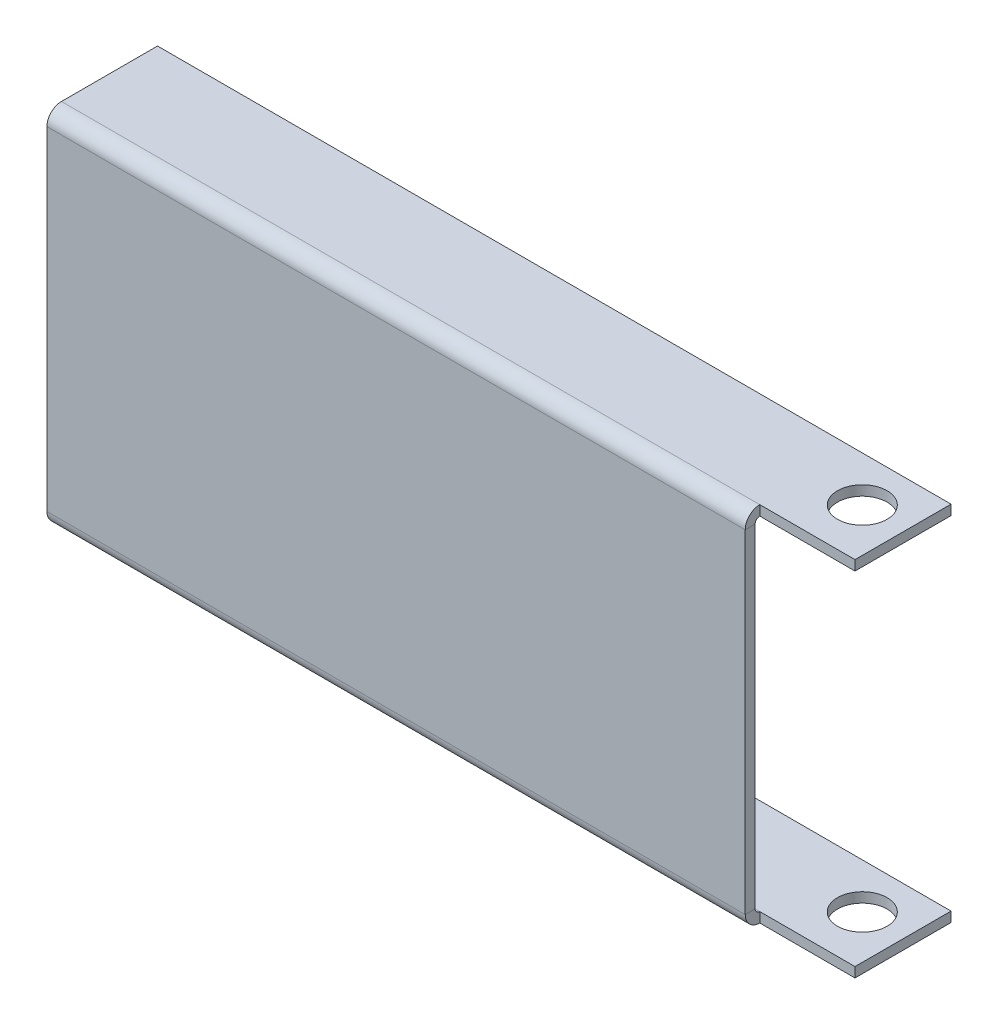
ISO-10303-21;
HEADER;
FILE_DESCRIPTION(('STEP AP214'),'2;1');
FILE_NAME('part.step','',(''),(''),'','','');
FILE_SCHEMA(('AUTOMOTIVE_DESIGN { 1 0 10303 214 1 1 1 1 }'));
ENDSEC;
DATA;
#1=APPLICATION_CONTEXT('core data for automotive mechanical design processes');
#2=APPLICATION_PROTOCOL_DEFINITION('international standard','automotive_design',2000,#1);
#3=PRODUCT_CONTEXT('',#1,'mechanical');
#4=PRODUCT('Part','Part','',(#3));
#5=PRODUCT_RELATED_PRODUCT_CATEGORY('part','',(#4));
#6=PRODUCT_DEFINITION_FORMATION('','',#4);
#7=PRODUCT_DEFINITION_CONTEXT('part definition',#1,'design');
#8=PRODUCT_DEFINITION('design','',#6,#7);
#9=PRODUCT_DEFINITION_SHAPE('','',#8);
#10=(LENGTH_UNIT() NAMED_UNIT(*) SI_UNIT(.MILLI.,.METRE.));
#11=(NAMED_UNIT(*) PLANE_ANGLE_UNIT() SI_UNIT($,.RADIAN.));
#12=(NAMED_UNIT(*) SI_UNIT($,.STERADIAN.) SOLID_ANGLE_UNIT());
#13=UNCERTAINTY_MEASURE_WITH_UNIT(LENGTH_MEASURE(1.E-05),#10,'distance_accuracy_value','');
#14=(GEOMETRIC_REPRESENTATION_CONTEXT(3) GLOBAL_UNCERTAINTY_ASSIGNED_CONTEXT((#13)) GLOBAL_UNIT_ASSIGNED_CONTEXT((#10,
#11,#12)) REPRESENTATION_CONTEXT('',''));
#15=CARTESIAN_POINT('',(0.,0.,0.));
#16=DIRECTION('',(0.,0.,1.));
#17=DIRECTION('',(1.,0.,0.));
#18=AXIS2_PLACEMENT_3D('',#15,#16,#17);
#19=CARTESIAN_POINT('',(0.,0.,-1.5875));
#20=DIRECTION('',(0.,0.,-1.));
#21=DIRECTION('',(-1.,0.,0.));
#22=AXIS2_PLACEMENT_3D('',#19,#20,#21);
#23=PLANE('',#22);
#24=DIRECTION('',(-1.,0.,0.));
#25=VECTOR('',#24,1.);
#26=CARTESIAN_POINT('',(0.,26.67,-1.5875));
#27=LINE('',#26,#25);
#28=CARTESIAN_POINT('',(48.26,26.67,-1.5875));
#29=VERTEX_POINT('',#28);
#30=CARTESIAN_POINT('',(-63.5,26.67,-1.5875));
#31=VERTEX_POINT('',#30);
#32=EDGE_CURVE('E229',#29,#31,#27,.T.);
#33=ORIENTED_EDGE('',*,*,#32,.F.);
#34=DIRECTION('',(0.,1.,0.));
#35=VECTOR('',#34,1.);
#36=CARTESIAN_POINT('',(48.26,0.,-1.5874999999999));
#37=LINE('',#36,#35);
#38=CARTESIAN_POINT('',(48.26,-26.67,-1.5875));
#39=VERTEX_POINT('',#38);
#40=EDGE_CURVE('E281',#29,#39,#37,.F.);
#41=ORIENTED_EDGE('',*,*,#40,.T.);
#42=DIRECTION('',(-1.,0.,0.));
#43=VECTOR('',#42,1.);
#44=CARTESIAN_POINT('',(0.,-26.67,-1.5875));
#45=LINE('',#44,#43);
#46=CARTESIAN_POINT('',(-63.5,-26.67,-1.5875));
#47=VERTEX_POINT('',#46);
#48=EDGE_CURVE('E237',#39,#47,#45,.T.);
#49=ORIENTED_EDGE('',*,*,#48,.T.);
#50=DIRECTION('',(0.,-1.,0.));
#51=VECTOR('',#50,1.);
#52=CARTESIAN_POINT('',(-63.5,44.4500000000001,-1.5875));
#53=LINE('',#52,#51);
#54=EDGE_CURVE('E232',#31,#47,#53,.T.);
#55=ORIENTED_EDGE('',*,*,#54,.F.);
#56=EDGE_LOOP('',(#33,#41,#49,#55));
#57=FACE_BOUND('',#56,.T.);
#58=ADVANCED_FACE('F46',(#57),#23,.T.);
#59=CARTESIAN_POINT('',(0.,0.,0.));
#60=DIRECTION('',(0.,0.,-1.));
#61=DIRECTION('',(-1.,0.,0.));
#62=AXIS2_PLACEMENT_3D('',#59,#60,#61);
#63=PLANE('',#62);
#64=DIRECTION('',(0.,-1.,0.));
#65=VECTOR('',#64,1.);
#66=CARTESIAN_POINT('',(48.26,-27.4066000000001,0.));
#67=LINE('',#66,#65);
#68=CARTESIAN_POINT('',(48.26,26.67,0.));
#69=VERTEX_POINT('',#68);
#70=CARTESIAN_POINT('',(48.26,-26.67,0.));
#71=VERTEX_POINT('',#70);
#72=EDGE_CURVE('E621',#69,#71,#67,.T.);
#73=ORIENTED_EDGE('',*,*,#72,.F.);
#74=DIRECTION('',(-1.,0.,0.));
#75=VECTOR('',#74,1.);
#76=CARTESIAN_POINT('',(0.,26.67,0.));
#77=LINE('',#76,#75);
#78=CARTESIAN_POINT('',(-63.5,26.67,0.));
#79=VERTEX_POINT('',#78);
#80=EDGE_CURVE('E235',#69,#79,#77,.T.);
#81=ORIENTED_EDGE('',*,*,#80,.T.);
#82=DIRECTION('',(0.,-1.,0.));
#83=VECTOR('',#82,1.);
#84=CARTESIAN_POINT('',(-63.5,44.4500000000001,0.));
#85=LINE('',#84,#83);
#86=CARTESIAN_POINT('',(-63.5,-26.67,0.));
#87=VERTEX_POINT('',#86);
#88=EDGE_CURVE('E50',#79,#87,#85,.T.);
#89=ORIENTED_EDGE('',*,*,#88,.T.);
#90=DIRECTION('',(-1.,0.,0.));
#91=VECTOR('',#90,1.);
#92=CARTESIAN_POINT('',(0.,-26.67,0.));
#93=LINE('',#92,#91);
#94=EDGE_CURVE('E55',#71,#87,#93,.T.);
#95=ORIENTED_EDGE('',*,*,#94,.F.);
#96=EDGE_LOOP('',(#73,#81,#89,#95));
#97=FACE_BOUND('',#96,.T.);
#98=ADVANCED_FACE('F247',(#97),#63,.F.);
#99=CARTESIAN_POINT('',(-127.032667996758,26.67,-2.3241));
#100=DIRECTION('',(1.,0.,0.));
#101=DIRECTION('',(0.,1.,0.));
#102=AXIS2_PLACEMENT_3D('',#99,#100,#101);
#103=CYLINDRICAL_SURFACE('',#102,0.7366);
#104=DIRECTION('',(-1.,0.,0.));
#105=VECTOR('',#104,1.);
#106=CARTESIAN_POINT('',(0.,27.4066,-2.3241));
#107=LINE('',#106,#105);
#108=CARTESIAN_POINT('',(48.26,27.4066,-2.3241));
#109=VERTEX_POINT('',#108);
#110=CARTESIAN_POINT('',(-63.5,27.4066,-2.3241));
#111=VERTEX_POINT('',#110);
#112=EDGE_CURVE('E216',#109,#111,#107,.T.);
#113=ORIENTED_EDGE('',*,*,#112,.F.);
#114=CARTESIAN_POINT('',(48.26,26.67,-2.3241));
#115=DIRECTION('',(1.,0.,0.));
#116=DIRECTION('',(0.,0.,-1.));
#117=AXIS2_PLACEMENT_3D('',#114,#115,#116);
#118=CIRCLE('',#117,0.7366);
#119=EDGE_CURVE('E259',#109,#29,#118,.T.);
#120=ORIENTED_EDGE('',*,*,#119,.T.);
#121=ORIENTED_EDGE('',*,*,#32,.T.);
#122=CARTESIAN_POINT('',(-63.5,26.67,-2.3241));
#123=DIRECTION('',(-1.,0.,0.));
#124=DIRECTION('',(0.,0.,-1.));
#125=AXIS2_PLACEMENT_3D('',#122,#123,#124);
#126=CIRCLE('',#125,0.7366);
#127=EDGE_CURVE('E224',#31,#111,#126,.T.);
#128=ORIENTED_EDGE('',*,*,#127,.T.);
#129=EDGE_LOOP('',(#113,#120,#121,#128));
#130=FACE_BOUND('',#129,.T.);
#131=ADVANCED_FACE('F298',(#130),#103,.F.);
#132=CARTESIAN_POINT('',(-127.032667996758,26.67,-2.3241));
#133=DIRECTION('',(1.,0.,0.));
#134=DIRECTION('',(0.,1.,0.));
#135=AXIS2_PLACEMENT_3D('',#132,#133,#134);
#136=CYLINDRICAL_SURFACE('',#135,2.3241);
#137=CARTESIAN_POINT('',(48.26,26.67,-2.3241));
#138=DIRECTION('',(-1.,0.,0.));
#139=DIRECTION('',(0.,-1.,0.));
#140=AXIS2_PLACEMENT_3D('',#137,#138,#139);
#141=CIRCLE('',#140,2.3241);
#142=CARTESIAN_POINT('',(48.26,28.9941,-2.32410000000001));
#143=VERTEX_POINT('',#142);
#144=EDGE_CURVE('E293',#143,#69,#141,.F.);
#145=ORIENTED_EDGE('',*,*,#144,.F.);
#146=DIRECTION('',(-1.,0.,0.));
#147=VECTOR('',#146,1.);
#148=CARTESIAN_POINT('',(0.,28.9941,-2.32410000000001));
#149=LINE('',#148,#147);
#150=CARTESIAN_POINT('',(-63.5,28.9941,-2.3241));
#151=VERTEX_POINT('',#150);
#152=EDGE_CURVE('E186',#143,#151,#149,.T.);
#153=ORIENTED_EDGE('',*,*,#152,.T.);
#154=CARTESIAN_POINT('',(-63.5,26.67,-2.3241));
#155=DIRECTION('',(1.,0.,0.));
#156=DIRECTION('',(0.,1.,0.));
#157=AXIS2_PLACEMENT_3D('',#154,#155,#156);
#158=CIRCLE('',#157,2.3241);
#159=EDGE_CURVE('E193',#79,#151,#158,.F.);
#160=ORIENTED_EDGE('',*,*,#159,.F.);
#161=ORIENTED_EDGE('',*,*,#80,.F.);
#162=EDGE_LOOP('',(#145,#153,#160,#161));
#163=FACE_BOUND('',#162,.T.);
#164=ADVANCED_FACE('F331',(#163),#136,.T.);
#165=CARTESIAN_POINT('',(127.032667996758,-26.6700000000001,-2.3241));
#166=DIRECTION('',(-1.,0.,0.));
#167=DIRECTION('',(0.,-1.,0.));
#168=AXIS2_PLACEMENT_3D('',#165,#166,#167);
#169=CYLINDRICAL_SURFACE('',#168,0.7366);
#170=ORIENTED_EDGE('',*,*,#48,.F.);
#171=CARTESIAN_POINT('',(48.26,-26.67,-2.32409999999999));
#172=DIRECTION('',(1.,0.,0.));
#173=DIRECTION('',(0.,1.,0.));
#174=AXIS2_PLACEMENT_3D('',#171,#172,#173);
#175=CIRCLE('',#174,0.736599999999995);
#176=CARTESIAN_POINT('',(48.26,-27.4066000000001,-2.32409999999997));
#177=VERTEX_POINT('',#176);
#178=EDGE_CURVE('E258',#39,#177,#175,.T.);
#179=ORIENTED_EDGE('',*,*,#178,.T.);
#180=DIRECTION('',(-1.,0.,0.));
#181=VECTOR('',#180,1.);
#182=CARTESIAN_POINT('',(0.,-27.4066,-2.32409999999997));
#183=LINE('',#182,#181);
#184=CARTESIAN_POINT('',(-63.5,-27.4066,-2.3241));
#185=VERTEX_POINT('',#184);
#186=EDGE_CURVE('E169',#177,#185,#183,.T.);
#187=ORIENTED_EDGE('',*,*,#186,.T.);
#188=CARTESIAN_POINT('',(-63.5,-26.67,-2.3241));
#189=DIRECTION('',(-1.,0.,0.));
#190=DIRECTION('',(0.,0.,-1.));
#191=AXIS2_PLACEMENT_3D('',#188,#189,#190);
#192=CIRCLE('',#191,0.7366);
#193=EDGE_CURVE('E183',#185,#47,#192,.T.);
#194=ORIENTED_EDGE('',*,*,#193,.T.);
#195=EDGE_LOOP('',(#170,#179,#187,#194));
#196=FACE_BOUND('',#195,.T.);
#197=ADVANCED_FACE('F255',(#196),#169,.F.);
#198=CARTESIAN_POINT('',(127.032667996758,-26.6700000000001,-2.3241));
#199=DIRECTION('',(-1.,0.,0.));
#200=DIRECTION('',(0.,-1.,0.));
#201=AXIS2_PLACEMENT_3D('',#198,#199,#200);
#202=CYLINDRICAL_SURFACE('',#201,2.3241);
#203=CARTESIAN_POINT('',(48.26,-26.67,-2.32409999999999));
#204=DIRECTION('',(-1.,0.,0.));
#205=DIRECTION('',(0.,-1.,0.));
#206=AXIS2_PLACEMENT_3D('',#203,#204,#205);
#207=CIRCLE('',#206,2.3241);
#208=CARTESIAN_POINT('',(48.26,-28.9941000000001,-2.32409999999997));
#209=VERTEX_POINT('',#208);
#210=EDGE_CURVE('E278',#71,#209,#207,.F.);
#211=ORIENTED_EDGE('',*,*,#210,.F.);
#212=ORIENTED_EDGE('',*,*,#94,.T.);
#213=CARTESIAN_POINT('',(-63.5,-26.67,-2.3241));
#214=DIRECTION('',(-1.,0.,0.));
#215=DIRECTION('',(0.,-1.,0.));
#216=AXIS2_PLACEMENT_3D('',#213,#214,#215);
#217=CIRCLE('',#216,2.3241);
#218=CARTESIAN_POINT('',(-63.5,-28.9941,-2.32409999999997));
#219=VERTEX_POINT('',#218);
#220=EDGE_CURVE('E187',#219,#87,#217,.T.);
#221=ORIENTED_EDGE('',*,*,#220,.F.);
#222=DIRECTION('',(-1.,0.,0.));
#223=VECTOR('',#222,1.);
#224=CARTESIAN_POINT('',(0.,-28.9941,-2.32409999999997));
#225=LINE('',#224,#223);
#226=EDGE_CURVE('E175',#209,#219,#225,.T.);
#227=ORIENTED_EDGE('',*,*,#226,.F.);
#228=EDGE_LOOP('',(#211,#212,#221,#227));
#229=FACE_BOUND('',#228,.T.);
#230=ADVANCED_FACE('F277',(#229),#202,.T.);
#231=CARTESIAN_POINT('',(-63.5,44.4500000000001,-1.5875));
#232=DIRECTION('',(-1.,0.,0.));
#233=DIRECTION('',(0.,-1.,0.));
#234=AXIS2_PLACEMENT_3D('',#231,#232,#233);
#235=PLANE('',#234);
#236=ORIENTED_EDGE('',*,*,#54,.T.);
#237=DIRECTION('',(0.,0.,1.));
#238=VECTOR('',#237,1.);
#239=CARTESIAN_POINT('',(-63.5,-26.67,-1.5875));
#240=LINE('',#239,#238);
#241=EDGE_CURVE('E12',#47,#87,#240,.T.);
#242=ORIENTED_EDGE('',*,*,#241,.T.);
#243=ORIENTED_EDGE('',*,*,#88,.F.);
#244=DIRECTION('',(0.,0.,1.));
#245=VECTOR('',#244,1.);
#246=CARTESIAN_POINT('',(-63.5,26.67,-1.5875));
#247=LINE('',#246,#245);
#248=EDGE_CURVE('E231',#31,#79,#247,.T.);
#249=ORIENTED_EDGE('',*,*,#248,.F.);
#250=EDGE_LOOP('',(#236,#242,#243,#249));
#251=FACE_BOUND('',#250,.T.);
#252=ADVANCED_FACE('F48',(#251),#235,.T.);
#253=CARTESIAN_POINT('',(-63.5,26.67,-2.3241));
#254=DIRECTION('',(1.,0.,0.));
#255=DIRECTION('',(0.,0.,-1.));
#256=AXIS2_PLACEMENT_3D('',#253,#254,#255);
#257=PLANE('',#256);
#258=ORIENTED_EDGE('',*,*,#159,.T.);
#259=DIRECTION('',(0.,1.,0.));
#260=VECTOR('',#259,1.);
#261=CARTESIAN_POINT('',(-63.5,27.4066,-2.3241));
#262=LINE('',#261,#260);
#263=EDGE_CURVE('E207',#111,#151,#262,.T.);
#264=ORIENTED_EDGE('',*,*,#263,.F.);
#265=ORIENTED_EDGE('',*,*,#127,.F.);
#266=ORIENTED_EDGE('',*,*,#248,.T.);
#267=EDGE_LOOP('',(#258,#264,#265,#266));
#268=FACE_BOUND('',#267,.T.);
#269=ADVANCED_FACE('F307',(#268),#257,.F.);
#270=CARTESIAN_POINT('',(63.5,27.4065999999999,-17.7002318412895));
#271=DIRECTION('',(0.,0.,-1.));
#272=DIRECTION('',(-1.,0.,0.));
#273=AXIS2_PLACEMENT_3D('',#270,#271,#272);
#274=PLANE('',#273);
#275=DIRECTION('',(-1.,0.,0.));
#276=VECTOR('',#275,1.);
#277=CARTESIAN_POINT('',(63.5,28.9940999999999,-17.7002318412895));
#278=LINE('',#277,#276);
#279=CARTESIAN_POINT('',(63.5,28.9940999999999,-17.7002318412895));
#280=VERTEX_POINT('',#279);
#281=CARTESIAN_POINT('',(-63.5,28.9941,-17.7002318412895));
#282=VERTEX_POINT('',#281);
#283=EDGE_CURVE('E202',#280,#282,#278,.T.);
#284=ORIENTED_EDGE('',*,*,#283,.F.);
#285=DIRECTION('',(0.,1.,0.));
#286=VECTOR('',#285,1.);
#287=CARTESIAN_POINT('',(63.5,27.4065999999999,-17.7002318412895));
#288=LINE('',#287,#286);
#289=CARTESIAN_POINT('',(63.5,27.4065999999999,-17.7002318412895));
#290=VERTEX_POINT('',#289);
#291=EDGE_CURVE('E190',#290,#280,#288,.T.);
#292=ORIENTED_EDGE('',*,*,#291,.F.);
#293=DIRECTION('',(-1.,0.,0.));
#294=VECTOR('',#293,1.);
#295=CARTESIAN_POINT('',(63.5,27.4065999999999,-17.7002318412895));
#296=LINE('',#295,#294);
#297=CARTESIAN_POINT('',(-63.5,27.4066,-17.7002318412895));
#298=VERTEX_POINT('',#297);
#299=EDGE_CURVE('E219',#290,#298,#296,.T.);
#300=ORIENTED_EDGE('',*,*,#299,.T.);
#301=DIRECTION('',(0.,1.,0.));
#302=VECTOR('',#301,1.);
#303=CARTESIAN_POINT('',(-63.5,27.4066,-17.7002318412895));
#304=LINE('',#303,#302);
#305=EDGE_CURVE('E217',#298,#282,#304,.T.);
#306=ORIENTED_EDGE('',*,*,#305,.T.);
#307=EDGE_LOOP('',(#284,#292,#300,#306));
#308=FACE_BOUND('',#307,.T.);
#309=ADVANCED_FACE('F319',(#308),#274,.T.);
#310=CARTESIAN_POINT('',(0.,27.4066000000001,26.7497681587106));
#311=DIRECTION('',(0.,-1.,0.));
#312=DIRECTION('',(-1.,0.,0.));
#313=AXIS2_PLACEMENT_3D('',#310,#311,#312);
#314=PLANE('',#313);
#315=CARTESIAN_POINT('',(56.515,27.4066,-10.4775));
#316=DIRECTION('',(0.,-1.,0.));
#317=DIRECTION('',(0.,0.,-1.));
#318=AXIS2_PLACEMENT_3D('',#315,#316,#317);
#319=CIRCLE('',#318,3.96875);
#320=CARTESIAN_POINT('',(56.515,27.4066,-14.44625));
#321=VERTEX_POINT('',#320);
#322=EDGE_CURVE('E607',#321,#321,#319,.T.);
#323=ORIENTED_EDGE('',*,*,#322,.F.);
#324=EDGE_LOOP('',(#323));
#325=FACE_BOUND('',#324,.T.);
#326=DIRECTION('',(0.,0.,-1.));
#327=VECTOR('',#326,1.);
#328=CARTESIAN_POINT('',(63.5,27.4065999999999,-17.7002318412895));
#329=LINE('',#328,#327);
#330=CARTESIAN_POINT('',(63.5,27.4066,-2.3241));
#331=VERTEX_POINT('',#330);
#332=EDGE_CURVE('E194',#331,#290,#329,.T.);
#333=ORIENTED_EDGE('',*,*,#332,.F.);
#334=EDGE_CURVE('E213',#331,#109,#107,.T.);
#335=ORIENTED_EDGE('',*,*,#334,.T.);
#336=ORIENTED_EDGE('',*,*,#112,.T.);
#337=DIRECTION('',(0.,0.,1.));
#338=VECTOR('',#337,1.);
#339=CARTESIAN_POINT('',(-63.5,27.4066,-17.7002318412895));
#340=LINE('',#339,#338);
#341=EDGE_CURVE('E210',#298,#111,#340,.T.);
#342=ORIENTED_EDGE('',*,*,#341,.F.);
#343=ORIENTED_EDGE('',*,*,#299,.F.);
#344=EDGE_LOOP('',(#333,#335,#336,#342,#343));
#345=FACE_BOUND('',#344,.T.);
#346=ADVANCED_FACE('F315',(#325,#345),#314,.T.);
#347=CARTESIAN_POINT('',(-63.5,27.4066,-17.7002318412895));
#348=DIRECTION('',(-1.,0.,0.));
#349=DIRECTION('',(0.,0.,1.));
#350=AXIS2_PLACEMENT_3D('',#347,#348,#349);
#351=PLANE('',#350);
#352=ORIENTED_EDGE('',*,*,#341,.T.);
#353=ORIENTED_EDGE('',*,*,#263,.T.);
#354=DIRECTION('',(0.,0.,1.));
#355=VECTOR('',#354,1.);
#356=CARTESIAN_POINT('',(-63.5,28.9941,-17.7002318412895));
#357=LINE('',#356,#355);
#358=EDGE_CURVE('E199',#282,#151,#357,.T.);
#359=ORIENTED_EDGE('',*,*,#358,.F.);
#360=ORIENTED_EDGE('',*,*,#305,.F.);
#361=EDGE_LOOP('',(#352,#353,#359,#360));
#362=FACE_BOUND('',#361,.T.);
#363=ADVANCED_FACE('F310',(#362),#351,.T.);
#364=CARTESIAN_POINT('',(0.,28.9941000000001,26.7497681587106));
#365=DIRECTION('',(0.,-1.,0.));
#366=DIRECTION('',(-1.,0.,0.));
#367=AXIS2_PLACEMENT_3D('',#364,#365,#366);
#368=PLANE('',#367);
#369=CARTESIAN_POINT('',(56.515,28.9941,-10.4775));
#370=DIRECTION('',(0.,1.,0.));
#371=DIRECTION('',(0.,0.,1.));
#372=AXIS2_PLACEMENT_3D('',#369,#370,#371);
#373=CIRCLE('',#372,3.96875);
#374=CARTESIAN_POINT('',(56.515,28.9941,-6.50875000000001));
#375=VERTEX_POINT('',#374);
#376=EDGE_CURVE('E609',#375,#375,#373,.T.);
#377=ORIENTED_EDGE('',*,*,#376,.F.);
#378=EDGE_LOOP('',(#377));
#379=FACE_BOUND('',#378,.T.);
#380=CARTESIAN_POINT('',(63.5,28.9941,-2.32410000000002));
#381=VERTEX_POINT('',#380);
#382=EDGE_CURVE('E222',#381,#143,#149,.T.);
#383=ORIENTED_EDGE('',*,*,#382,.F.);
#384=DIRECTION('',(0.,0.,-1.));
#385=VECTOR('',#384,1.);
#386=CARTESIAN_POINT('',(63.5,28.9940999999999,-17.7002318412895));
#387=LINE('',#386,#385);
#388=EDGE_CURVE('E205',#381,#280,#387,.T.);
#389=ORIENTED_EDGE('',*,*,#388,.T.);
#390=ORIENTED_EDGE('',*,*,#283,.T.);
#391=ORIENTED_EDGE('',*,*,#358,.T.);
#392=ORIENTED_EDGE('',*,*,#152,.F.);
#393=EDGE_LOOP('',(#383,#389,#390,#391,#392));
#394=FACE_BOUND('',#393,.T.);
#395=ADVANCED_FACE('F333',(#379,#394),#368,.F.);
#396=CARTESIAN_POINT('',(63.5,27.4065999999999,-17.7002318412895));
#397=DIRECTION('',(1.,0.,0.));
#398=DIRECTION('',(0.,0.,-1.));
#399=AXIS2_PLACEMENT_3D('',#396,#397,#398);
#400=PLANE('',#399);
#401=ORIENTED_EDGE('',*,*,#388,.F.);
#402=DIRECTION('',(0.,-1.,0.));
#403=VECTOR('',#402,1.);
#404=CARTESIAN_POINT('',(63.5,27.4066,-2.3241));
#405=LINE('',#404,#403);
#406=EDGE_CURVE('E196',#381,#331,#405,.T.);
#407=ORIENTED_EDGE('',*,*,#406,.T.);
#408=ORIENTED_EDGE('',*,*,#332,.T.);
#409=ORIENTED_EDGE('',*,*,#291,.T.);
#410=EDGE_LOOP('',(#401,#407,#408,#409));
#411=FACE_BOUND('',#410,.T.);
#412=ADVANCED_FACE('F322',(#411),#400,.T.);
#413=CARTESIAN_POINT('',(-63.5,-26.67,-2.3241));
#414=DIRECTION('',(1.,0.,0.));
#415=DIRECTION('',(0.,0.,-1.));
#416=AXIS2_PLACEMENT_3D('',#413,#414,#415);
#417=PLANE('',#416);
#418=DIRECTION('',(0.,-1.,0.));
#419=VECTOR('',#418,1.);
#420=CARTESIAN_POINT('',(-63.5,-27.4066,-2.32409999999996));
#421=LINE('',#420,#419);
#422=EDGE_CURVE('E159',#185,#219,#421,.T.);
#423=ORIENTED_EDGE('',*,*,#422,.T.);
#424=ORIENTED_EDGE('',*,*,#220,.T.);
#425=ORIENTED_EDGE('',*,*,#241,.F.);
#426=ORIENTED_EDGE('',*,*,#193,.F.);
#427=EDGE_LOOP('',(#423,#424,#425,#426));
#428=FACE_BOUND('',#427,.T.);
#429=ADVANCED_FACE('F252',(#428),#417,.F.);
#430=CARTESIAN_POINT('',(63.5,-27.4066,-17.7002318412893));
#431=DIRECTION('',(0.,0.,-1.));
#432=DIRECTION('',(1.,0.,0.));
#433=AXIS2_PLACEMENT_3D('',#430,#431,#432);
#434=PLANE('',#433);
#435=DIRECTION('',(1.,0.,0.));
#436=VECTOR('',#435,1.);
#437=CARTESIAN_POINT('',(63.5,-28.9941,-17.7002318412893));
#438=LINE('',#437,#436);
#439=CARTESIAN_POINT('',(-63.5,-28.9941,-17.7002318412894));
#440=VERTEX_POINT('',#439);
#441=CARTESIAN_POINT('',(63.5,-28.9941,-17.7002318412893));
#442=VERTEX_POINT('',#441);
#443=EDGE_CURVE('E267',#440,#442,#438,.T.);
#444=ORIENTED_EDGE('',*,*,#443,.F.);
#445=DIRECTION('',(0.,-1.,0.));
#446=VECTOR('',#445,1.);
#447=CARTESIAN_POINT('',(-63.5,-27.4066,-17.7002318412894));
#448=LINE('',#447,#446);
#449=CARTESIAN_POINT('',(-63.5,-27.4066,-17.7002318412894));
#450=VERTEX_POINT('',#449);
#451=EDGE_CURVE('E189',#450,#440,#448,.T.);
#452=ORIENTED_EDGE('',*,*,#451,.F.);
#453=DIRECTION('',(1.,0.,0.));
#454=VECTOR('',#453,1.);
#455=CARTESIAN_POINT('',(63.5,-27.4066,-17.7002318412893));
#456=LINE('',#455,#454);
#457=CARTESIAN_POINT('',(63.5,-27.4066,-17.7002318412893));
#458=VERTEX_POINT('',#457);
#459=EDGE_CURVE('E158',#450,#458,#456,.T.);
#460=ORIENTED_EDGE('',*,*,#459,.T.);
#461=DIRECTION('',(0.,-1.,0.));
#462=VECTOR('',#461,1.);
#463=CARTESIAN_POINT('',(63.5,-27.4066,-17.7002318412893));
#464=LINE('',#463,#462);
#465=EDGE_CURVE('E172',#458,#442,#464,.T.);
#466=ORIENTED_EDGE('',*,*,#465,.T.);
#467=EDGE_LOOP('',(#444,#452,#460,#466));
#468=FACE_BOUND('',#467,.T.);
#469=ADVANCED_FACE('F414',(#468),#434,.T.);
#470=CARTESIAN_POINT('',(0.,-27.4066000000001,26.7497681587106));
#471=DIRECTION('',(0.,1.,0.));
#472=DIRECTION('',(-1.,0.,0.));
#473=AXIS2_PLACEMENT_3D('',#470,#471,#472);
#474=PLANE('',#473);
#475=CARTESIAN_POINT('',(56.515,-27.4066,-10.4774999999998));
#476=DIRECTION('',(0.,1.,0.));
#477=DIRECTION('',(0.,0.,1.));
#478=AXIS2_PLACEMENT_3D('',#475,#476,#477);
#479=CIRCLE('',#478,3.96875);
#480=CARTESIAN_POINT('',(56.515,-27.4066000000001,-6.50874999999982));
#481=VERTEX_POINT('',#480);
#482=EDGE_CURVE('E613',#481,#481,#479,.T.);
#483=ORIENTED_EDGE('',*,*,#482,.F.);
#484=EDGE_LOOP('',(#483));
#485=FACE_BOUND('',#484,.T.);
#486=CARTESIAN_POINT('',(63.5,-27.4066000000001,-2.32409999999993));
#487=VERTEX_POINT('',#486);
#488=EDGE_CURVE('E151',#487,#177,#183,.T.);
#489=ORIENTED_EDGE('',*,*,#488,.F.);
#490=DIRECTION('',(0.,0.,1.));
#491=VECTOR('',#490,1.);
#492=CARTESIAN_POINT('',(63.4999999999999,-27.4066000000003,71.1997681587107));
#493=LINE('',#492,#491);
#494=EDGE_CURVE('E166',#458,#487,#493,.T.);
#495=ORIENTED_EDGE('',*,*,#494,.F.);
#496=ORIENTED_EDGE('',*,*,#459,.F.);
#497=DIRECTION('',(0.,0.,-1.));
#498=VECTOR('',#497,1.);
#499=CARTESIAN_POINT('',(-63.5000000000001,-27.4066000000003,71.1997681587106));
#500=LINE('',#499,#498);
#501=EDGE_CURVE('E264',#185,#450,#500,.T.);
#502=ORIENTED_EDGE('',*,*,#501,.F.);
#503=ORIENTED_EDGE('',*,*,#186,.F.);
#504=EDGE_LOOP('',(#489,#495,#496,#502,#503));
#505=FACE_BOUND('',#504,.T.);
#506=ADVANCED_FACE('F164',(#485,#505),#474,.T.);
#507=CARTESIAN_POINT('',(63.4999999999999,-27.4066000000003,71.1997681587107));
#508=DIRECTION('',(1.,0.,0.));
#509=DIRECTION('',(0.,0.,1.));
#510=AXIS2_PLACEMENT_3D('',#507,#508,#509);
#511=PLANE('',#510);
#512=DIRECTION('',(0.,1.,0.));
#513=VECTOR('',#512,1.);
#514=CARTESIAN_POINT('',(63.5,-27.4066000000001,-2.32409999999997));
#515=LINE('',#514,#513);
#516=CARTESIAN_POINT('',(63.5,-28.9941000000001,-2.32409999999997));
#517=VERTEX_POINT('',#516);
#518=EDGE_CURVE('E148',#517,#487,#515,.T.);
#519=ORIENTED_EDGE('',*,*,#518,.F.);
#520=DIRECTION('',(0.,0.,1.));
#521=VECTOR('',#520,1.);
#522=CARTESIAN_POINT('',(63.4999999999999,-28.9941000000003,71.1997681587107));
#523=LINE('',#522,#521);
#524=EDGE_CURVE('E173',#442,#517,#523,.T.);
#525=ORIENTED_EDGE('',*,*,#524,.F.);
#526=ORIENTED_EDGE('',*,*,#465,.F.);
#527=ORIENTED_EDGE('',*,*,#494,.T.);
#528=EDGE_LOOP('',(#519,#525,#526,#527));
#529=FACE_BOUND('',#528,.T.);
#530=ADVANCED_FACE('F171',(#529),#511,.T.);
#531=CARTESIAN_POINT('',(0.,-28.9941000000001,26.7497681587106));
#532=DIRECTION('',(0.,1.,0.));
#533=DIRECTION('',(-1.,0.,0.));
#534=AXIS2_PLACEMENT_3D('',#531,#532,#533);
#535=PLANE('',#534);
#536=CARTESIAN_POINT('',(56.515,-28.9941,-10.4774999999998));
#537=DIRECTION('',(0.,1.,0.));
#538=DIRECTION('',(0.,0.,1.));
#539=AXIS2_PLACEMENT_3D('',#536,#537,#538);
#540=CIRCLE('',#539,3.96875);
#541=CARTESIAN_POINT('',(56.515,-28.9941000000001,-6.50874999999981));
#542=VERTEX_POINT('',#541);
#543=EDGE_CURVE('E610',#542,#542,#540,.F.);
#544=ORIENTED_EDGE('',*,*,#543,.F.);
#545=EDGE_LOOP('',(#544));
#546=FACE_BOUND('',#545,.T.);
#547=ORIENTED_EDGE('',*,*,#524,.T.);
#548=EDGE_CURVE('E153',#517,#209,#225,.T.);
#549=ORIENTED_EDGE('',*,*,#548,.T.);
#550=ORIENTED_EDGE('',*,*,#226,.T.);
#551=DIRECTION('',(0.,0.,-1.));
#552=VECTOR('',#551,1.);
#553=CARTESIAN_POINT('',(-63.5000000000001,-28.9941000000003,71.1997681587106));
#554=LINE('',#553,#552);
#555=EDGE_CURVE('E266',#219,#440,#554,.T.);
#556=ORIENTED_EDGE('',*,*,#555,.T.);
#557=ORIENTED_EDGE('',*,*,#443,.T.);
#558=EDGE_LOOP('',(#547,#549,#550,#556,#557));
#559=FACE_BOUND('',#558,.T.);
#560=ADVANCED_FACE('F276',(#546,#559),#535,.F.);
#561=CARTESIAN_POINT('',(-63.5000000000001,-27.4066000000003,71.1997681587106));
#562=DIRECTION('',(-1.,0.,0.));
#563=DIRECTION('',(0.,0.,-1.));
#564=AXIS2_PLACEMENT_3D('',#561,#562,#563);
#565=PLANE('',#564);
#566=ORIENTED_EDGE('',*,*,#422,.F.);
#567=ORIENTED_EDGE('',*,*,#501,.T.);
#568=ORIENTED_EDGE('',*,*,#451,.T.);
#569=ORIENTED_EDGE('',*,*,#555,.F.);
#570=EDGE_LOOP('',(#566,#567,#568,#569));
#571=FACE_BOUND('',#570,.T.);
#572=ADVANCED_FACE('F262',(#571),#565,.T.);
#573=CARTESIAN_POINT('',(48.26,26.67,-2.3241));
#574=DIRECTION('',(-1.,0.,0.));
#575=DIRECTION('',(0.,0.,1.));
#576=AXIS2_PLACEMENT_3D('',#573,#574,#575);
#577=PLANE('',#576);
#578=DIRECTION('',(0.,1.,0.));
#579=VECTOR('',#578,1.);
#580=CARTESIAN_POINT('',(48.26,27.4066000000001,-2.3241));
#581=LINE('',#580,#579);
#582=EDGE_CURVE('E290',#109,#143,#581,.T.);
#583=ORIENTED_EDGE('',*,*,#582,.T.);
#584=ORIENTED_EDGE('',*,*,#144,.T.);
#585=DIRECTION('',(0.,0.,1.));
#586=VECTOR('',#585,1.);
#587=CARTESIAN_POINT('',(48.26,26.67,-1.5874999999999));
#588=LINE('',#587,#586);
#589=EDGE_CURVE('E619',#29,#69,#588,.T.);
#590=ORIENTED_EDGE('',*,*,#589,.F.);
#591=ORIENTED_EDGE('',*,*,#119,.F.);
#592=EDGE_LOOP('',(#583,#584,#590,#591));
#593=FACE_BOUND('',#592,.T.);
#594=ADVANCED_FACE('F327',(#593),#577,.F.);
#595=CARTESIAN_POINT('',(55.8800000000001,27.4066,-2.3241));
#596=DIRECTION('',(0.,0.,-1.));
#597=DIRECTION('',(-1.,0.,0.));
#598=AXIS2_PLACEMENT_3D('',#595,#596,#597);
#599=PLANE('',#598);
#600=ORIENTED_EDGE('',*,*,#582,.F.);
#601=ORIENTED_EDGE('',*,*,#334,.F.);
#602=ORIENTED_EDGE('',*,*,#406,.F.);
#603=ORIENTED_EDGE('',*,*,#382,.T.);
#604=EDGE_LOOP('',(#600,#601,#602,#603));
#605=FACE_BOUND('',#604,.T.);
#606=ADVANCED_FACE('F325',(#605),#599,.F.);
#607=CARTESIAN_POINT('',(55.8800000000001,-27.4066000000002,-2.32409999999997));
#608=DIRECTION('',(0.,0.,1.));
#609=DIRECTION('',(-1.,0.,0.));
#610=AXIS2_PLACEMENT_3D('',#607,#608,#609);
#611=PLANE('',#610);
#612=ORIENTED_EDGE('',*,*,#518,.T.);
#613=ORIENTED_EDGE('',*,*,#488,.T.);
#614=DIRECTION('',(0.,-1.,1.00089258388555E-13));
#615=VECTOR('',#614,1.);
#616=CARTESIAN_POINT('',(48.26,-27.4066000000002,-2.32409999999994));
#617=LINE('',#616,#615);
#618=EDGE_CURVE('E63',#177,#209,#617,.T.);
#619=ORIENTED_EDGE('',*,*,#618,.T.);
#620=ORIENTED_EDGE('',*,*,#548,.F.);
#621=EDGE_LOOP('',(#612,#613,#619,#620));
#622=FACE_BOUND('',#621,.T.);
#623=ADVANCED_FACE('F150',(#622),#611,.T.);
#624=CARTESIAN_POINT('',(48.26,-26.67,-2.32409999999999));
#625=DIRECTION('',(-1.,0.,0.));
#626=DIRECTION('',(0.,-1.,0.));
#627=AXIS2_PLACEMENT_3D('',#624,#625,#626);
#628=PLANE('',#627);
#629=DIRECTION('',(0.,0.,1.));
#630=VECTOR('',#629,1.);
#631=CARTESIAN_POINT('',(48.26,-26.67,-1.5874999999999));
#632=LINE('',#631,#630);
#633=EDGE_CURVE('E285',#39,#71,#632,.T.);
#634=ORIENTED_EDGE('',*,*,#633,.T.);
#635=ORIENTED_EDGE('',*,*,#210,.T.);
#636=ORIENTED_EDGE('',*,*,#618,.F.);
#637=ORIENTED_EDGE('',*,*,#178,.F.);
#638=EDGE_LOOP('',(#634,#635,#636,#637));
#639=FACE_BOUND('',#638,.T.);
#640=ADVANCED_FACE('F552',(#639),#628,.F.);
#641=CARTESIAN_POINT('',(48.26,-27.4066000000001,0.));
#642=DIRECTION('',(1.,0.,0.));
#643=DIRECTION('',(0.,-1.,0.));
#644=AXIS2_PLACEMENT_3D('',#641,#642,#643);
#645=PLANE('',#644);
#646=ORIENTED_EDGE('',*,*,#589,.T.);
#647=ORIENTED_EDGE('',*,*,#72,.T.);
#648=ORIENTED_EDGE('',*,*,#633,.F.);
#649=ORIENTED_EDGE('',*,*,#40,.F.);
#650=EDGE_LOOP('',(#646,#647,#648,#649));
#651=FACE_BOUND('',#650,.T.);
#652=ADVANCED_FACE('F561',(#651),#645,.T.);
#653=CARTESIAN_POINT('',(56.515,-40.2194201513365,-10.4774999999998));
#654=DIRECTION('',(0.,1.,0.));
#655=DIRECTION('',(0.,0.,1.));
#656=AXIS2_PLACEMENT_3D('',#653,#654,#655);
#657=CYLINDRICAL_SURFACE('',#656,3.96875);
#658=ORIENTED_EDGE('',*,*,#482,.T.);
#659=EDGE_LOOP('',(#658));
#660=FACE_BOUND('',#659,.T.);
#661=ORIENTED_EDGE('',*,*,#543,.T.);
#662=EDGE_LOOP('',(#661));
#663=FACE_BOUND('',#662,.T.);
#664=ADVANCED_FACE('F570',(#660,#663),#657,.F.);
#665=ORIENTED_EDGE('',*,*,#322,.T.);
#666=EDGE_LOOP('',(#665));
#667=FACE_BOUND('',#666,.T.);
#668=ORIENTED_EDGE('',*,*,#376,.T.);
#669=EDGE_LOOP('',(#668));
#670=FACE_BOUND('',#669,.T.);
#671=ADVANCED_FACE('F581',(#667,#670),#657,.F.);
#672=CLOSED_SHELL('',(#58,#98,#131,#164,#197,#230,#252,#269,#309,#346,#363,#395,#412,#429,#469,
#506,#530,#560,#572,#594,#606,#623,#640,#652,#664,#671));
#673=MANIFOLD_SOLID_BREP('B2',#672);
#674=ADVANCED_BREP_SHAPE_REPRESENTATION('',(#18,#673),#14);
#675=SHAPE_DEFINITION_REPRESENTATION(#9,#674);
ENDSEC;
END-ISO-10303-21;
